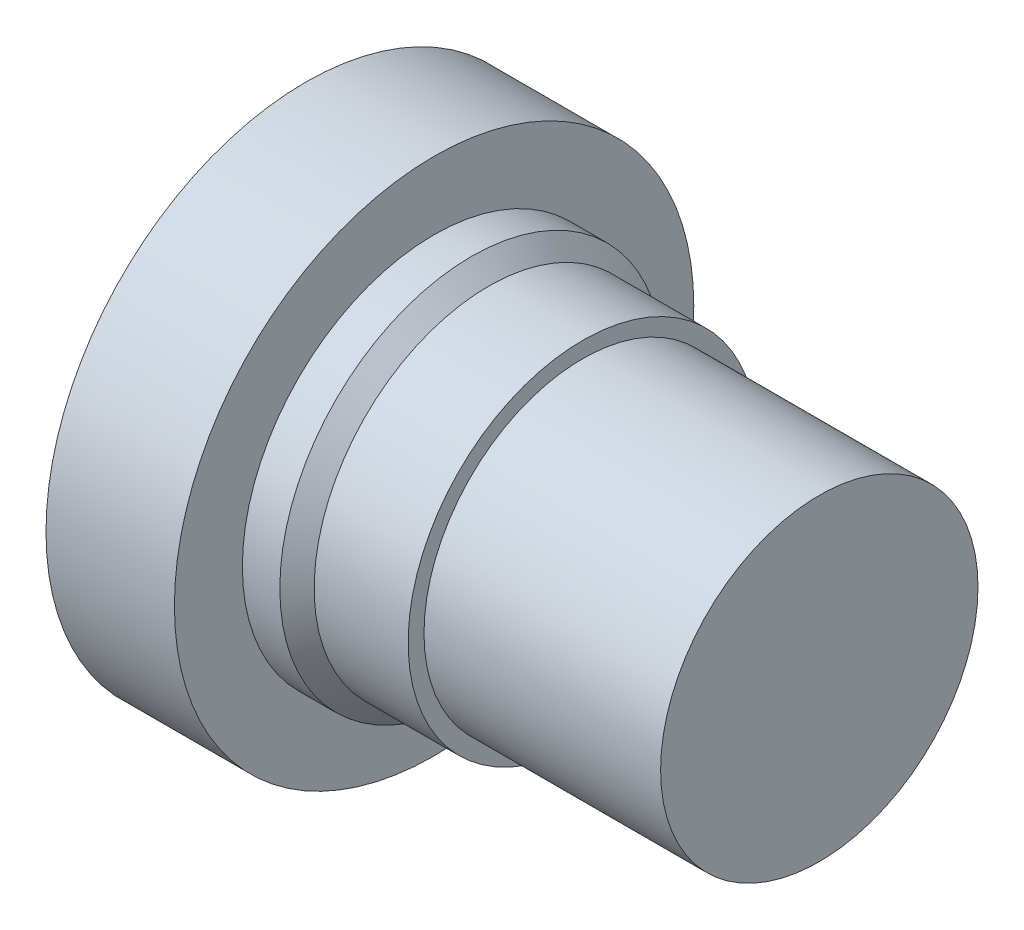
ISO-10303-21;
HEADER;
FILE_DESCRIPTION(('STEP AP214'),'2;1');
FILE_NAME('part.step','',(''),(''),'','','');
FILE_SCHEMA(('AUTOMOTIVE_DESIGN { 1 0 10303 214 1 1 1 1 }'));
ENDSEC;
DATA;
#1=APPLICATION_CONTEXT('core data for automotive mechanical design processes');
#2=APPLICATION_PROTOCOL_DEFINITION('international standard','automotive_design',2000,#1);
#3=PRODUCT_CONTEXT('',#1,'mechanical');
#4=PRODUCT('Part','Part','',(#3));
#5=PRODUCT_RELATED_PRODUCT_CATEGORY('part','',(#4));
#6=PRODUCT_DEFINITION_FORMATION('','',#4);
#7=PRODUCT_DEFINITION_CONTEXT('part definition',#1,'design');
#8=PRODUCT_DEFINITION('design','',#6,#7);
#9=PRODUCT_DEFINITION_SHAPE('','',#8);
#10=(LENGTH_UNIT() NAMED_UNIT(*) SI_UNIT(.MILLI.,.METRE.));
#11=(NAMED_UNIT(*) PLANE_ANGLE_UNIT() SI_UNIT($,.RADIAN.));
#12=(NAMED_UNIT(*) SI_UNIT($,.STERADIAN.) SOLID_ANGLE_UNIT());
#13=UNCERTAINTY_MEASURE_WITH_UNIT(LENGTH_MEASURE(1.E-05),#10,'distance_accuracy_value','');
#14=(GEOMETRIC_REPRESENTATION_CONTEXT(3) GLOBAL_UNCERTAINTY_ASSIGNED_CONTEXT((#13)) GLOBAL_UNIT_ASSIGNED_CONTEXT((#10,
#11,#12)) REPRESENTATION_CONTEXT('',''));
#15=CARTESIAN_POINT('',(0.,0.,0.));
#16=DIRECTION('',(0.,0.,1.));
#17=DIRECTION('',(1.,0.,0.));
#18=AXIS2_PLACEMENT_3D('',#15,#16,#17);
#19=CARTESIAN_POINT('',(0.,0.,0.));
#20=DIRECTION('',(-1.,0.,0.));
#21=DIRECTION('',(0.,0.,1.));
#22=AXIS2_PLACEMENT_3D('',#19,#20,#21);
#23=PLANE('',#22);
#24=CARTESIAN_POINT('',(0.,0.,0.));
#25=DIRECTION('',(-1.,0.,0.));
#26=DIRECTION('',(0.,0.,1.));
#27=AXIS2_PLACEMENT_3D('',#24,#25,#26);
#28=CIRCLE('',#27,7.);
#29=CARTESIAN_POINT('',(0.,0.,7.));
#30=VERTEX_POINT('',#29);
#31=EDGE_CURVE('E52',#30,#30,#28,.T.);
#32=ORIENTED_EDGE('',*,*,#31,.F.);
#33=EDGE_LOOP('',(#32));
#34=FACE_BOUND('',#33,.T.);
#35=CARTESIAN_POINT('',(0.,0.,0.));
#36=DIRECTION('',(1.,0.,0.));
#37=DIRECTION('',(0.,0.,-1.));
#38=AXIS2_PLACEMENT_3D('',#35,#36,#37);
#39=CIRCLE('',#38,9.);
#40=CARTESIAN_POINT('',(0.,0.,-9.));
#41=VERTEX_POINT('',#40);
#42=EDGE_CURVE('E11',#41,#41,#39,.T.);
#43=ORIENTED_EDGE('',*,*,#42,.F.);
#44=EDGE_LOOP('',(#43));
#45=FACE_BOUND('',#44,.T.);
#46=ADVANCED_FACE('F32',(#34,#45),#23,.T.);
#47=CARTESIAN_POINT('',(17.8,0.,0.));
#48=DIRECTION('',(1.,0.,0.));
#49=DIRECTION('',(0.,0.,-1.));
#50=AXIS2_PLACEMENT_3D('',#47,#48,#49);
#51=CYLINDRICAL_SURFACE('',#50,9.);
#52=ORIENTED_EDGE('',*,*,#42,.T.);
#53=EDGE_LOOP('',(#52));
#54=FACE_BOUND('',#53,.T.);
#55=CARTESIAN_POINT('',(4.45,0.,0.));
#56=DIRECTION('',(1.,0.,0.));
#57=DIRECTION('',(0.,0.,-1.));
#58=AXIS2_PLACEMENT_3D('',#55,#56,#57);
#59=CIRCLE('',#58,9.);
#60=CARTESIAN_POINT('',(4.45,0.,-9.));
#61=VERTEX_POINT('',#60);
#62=EDGE_CURVE('E40',#61,#61,#59,.T.);
#63=ORIENTED_EDGE('',*,*,#62,.F.);
#64=EDGE_LOOP('',(#63));
#65=FACE_BOUND('',#64,.T.);
#66=ADVANCED_FACE('F94',(#54,#65),#51,.T.);
#67=CARTESIAN_POINT('',(4.45,9.,0.));
#68=DIRECTION('',(1.,0.,0.));
#69=DIRECTION('',(0.,0.,-1.));
#70=AXIS2_PLACEMENT_3D('',#67,#68,#69);
#71=PLANE('',#70);
#72=ORIENTED_EDGE('',*,*,#62,.T.);
#73=EDGE_LOOP('',(#72));
#74=FACE_BOUND('',#73,.T.);
#75=CARTESIAN_POINT('',(4.45,0.,0.));
#76=DIRECTION('',(1.,0.,0.));
#77=DIRECTION('',(0.,0.,-1.));
#78=AXIS2_PLACEMENT_3D('',#75,#76,#77);
#79=CIRCLE('',#78,6.64519038076152);
#80=CARTESIAN_POINT('',(4.45,0.,-6.64519038076152));
#81=VERTEX_POINT('',#80);
#82=EDGE_CURVE('E61',#81,#81,#79,.T.);
#83=ORIENTED_EDGE('',*,*,#82,.F.);
#84=EDGE_LOOP('',(#83));
#85=FACE_BOUND('',#84,.T.);
#86=ADVANCED_FACE('F99',(#74,#85),#71,.T.);
#87=CARTESIAN_POINT('',(17.8,0.,0.));
#88=DIRECTION('',(1.,0.,0.));
#89=DIRECTION('',(0.,0.,-1.));
#90=AXIS2_PLACEMENT_3D('',#87,#88,#89);
#91=CYLINDRICAL_SURFACE('',#90,6.64519038076152);
#92=ORIENTED_EDGE('',*,*,#82,.T.);
#93=EDGE_LOOP('',(#92));
#94=FACE_BOUND('',#93,.T.);
#95=CARTESIAN_POINT('',(5.74859719438878,0.,0.));
#96=DIRECTION('',(1.,0.,0.));
#97=DIRECTION('',(0.,0.,-1.));
#98=AXIS2_PLACEMENT_3D('',#95,#96,#97);
#99=CIRCLE('',#98,6.64519038076152);
#100=CARTESIAN_POINT('',(5.74859719438878,0.,-6.64519038076152));
#101=VERTEX_POINT('',#100);
#102=EDGE_CURVE('E64',#101,#101,#99,.T.);
#103=ORIENTED_EDGE('',*,*,#102,.F.);
#104=EDGE_LOOP('',(#103));
#105=FACE_BOUND('',#104,.T.);
#106=ADVANCED_FACE('F107',(#94,#105),#91,.T.);
#107=CARTESIAN_POINT('',(6.34378757515031,0.,0.));
#108=DIRECTION('',(-1.,0.,0.));
#109=DIRECTION('',(0.,0.,1.));
#110=AXIS2_PLACEMENT_3D('',#107,#108,#109);
#111=CONICAL_SURFACE('',#110,6.05,0.785398163397447);
#112=ORIENTED_EDGE('',*,*,#102,.T.);
#113=EDGE_LOOP('',(#112));
#114=FACE_BOUND('',#113,.T.);
#115=CARTESIAN_POINT('',(6.34378757515031,0.,0.));
#116=DIRECTION('',(1.,0.,0.));
#117=DIRECTION('',(0.,0.,-1.));
#118=AXIS2_PLACEMENT_3D('',#115,#116,#117);
#119=CIRCLE('',#118,6.05);
#120=CARTESIAN_POINT('',(6.34378757515031,0.,-6.05));
#121=VERTEX_POINT('',#120);
#122=EDGE_CURVE('E67',#121,#121,#119,.T.);
#123=ORIENTED_EDGE('',*,*,#122,.F.);
#124=EDGE_LOOP('',(#123));
#125=FACE_BOUND('',#124,.T.);
#126=ADVANCED_FACE('F90',(#114,#125),#111,.T.);
#127=CARTESIAN_POINT('',(17.8,0.,0.));
#128=DIRECTION('',(1.,0.,0.));
#129=DIRECTION('',(0.,0.,-1.));
#130=AXIS2_PLACEMENT_3D('',#127,#128,#129);
#131=CYLINDRICAL_SURFACE('',#130,6.05);
#132=ORIENTED_EDGE('',*,*,#122,.T.);
#133=EDGE_LOOP('',(#132));
#134=FACE_BOUND('',#133,.T.);
#135=CARTESIAN_POINT('',(9.6,0.,0.));
#136=DIRECTION('',(1.,0.,0.));
#137=DIRECTION('',(0.,0.,-1.));
#138=AXIS2_PLACEMENT_3D('',#135,#136,#137);
#139=CIRCLE('',#138,6.05);
#140=CARTESIAN_POINT('',(9.6,0.,-6.05));
#141=VERTEX_POINT('',#140);
#142=EDGE_CURVE('E70',#141,#141,#139,.T.);
#143=ORIENTED_EDGE('',*,*,#142,.F.);
#144=EDGE_LOOP('',(#143));
#145=FACE_BOUND('',#144,.T.);
#146=ADVANCED_FACE('F81',(#134,#145),#131,.T.);
#147=CARTESIAN_POINT('',(9.6,6.05,0.));
#148=DIRECTION('',(1.,0.,0.));
#149=DIRECTION('',(0.,0.,-1.));
#150=AXIS2_PLACEMENT_3D('',#147,#148,#149);
#151=PLANE('',#150);
#152=ORIENTED_EDGE('',*,*,#142,.T.);
#153=EDGE_LOOP('',(#152));
#154=FACE_BOUND('',#153,.T.);
#155=CARTESIAN_POINT('',(9.6,0.,0.));
#156=DIRECTION('',(1.,0.,0.));
#157=DIRECTION('',(0.,0.,-1.));
#158=AXIS2_PLACEMENT_3D('',#155,#156,#157);
#159=CIRCLE('',#158,5.5);
#160=CARTESIAN_POINT('',(9.6,0.,-5.5));
#161=VERTEX_POINT('',#160);
#162=EDGE_CURVE('E54',#161,#161,#159,.T.);
#163=ORIENTED_EDGE('',*,*,#162,.F.);
#164=EDGE_LOOP('',(#163));
#165=FACE_BOUND('',#164,.T.);
#166=ADVANCED_FACE('F79',(#154,#165),#151,.T.);
#167=CARTESIAN_POINT('',(17.8,0.,0.));
#168=DIRECTION('',(1.,0.,0.));
#169=DIRECTION('',(0.,0.,-1.));
#170=AXIS2_PLACEMENT_3D('',#167,#168,#169);
#171=CYLINDRICAL_SURFACE('',#170,5.5);
#172=ORIENTED_EDGE('',*,*,#162,.T.);
#173=EDGE_LOOP('',(#172));
#174=FACE_BOUND('',#173,.T.);
#175=CARTESIAN_POINT('',(17.8,0.,0.));
#176=DIRECTION('',(1.,0.,0.));
#177=DIRECTION('',(0.,0.,-1.));
#178=AXIS2_PLACEMENT_3D('',#175,#176,#177);
#179=CIRCLE('',#178,5.5);
#180=CARTESIAN_POINT('',(17.8,0.,-5.5));
#181=VERTEX_POINT('',#180);
#182=EDGE_CURVE('E51',#181,#181,#179,.T.);
#183=ORIENTED_EDGE('',*,*,#182,.F.);
#184=EDGE_LOOP('',(#183));
#185=FACE_BOUND('',#184,.T.);
#186=ADVANCED_FACE('F76',(#174,#185),#171,.T.);
#187=CARTESIAN_POINT('',(17.8,5.5,0.));
#188=DIRECTION('',(1.,0.,0.));
#189=DIRECTION('',(0.,0.,-1.));
#190=AXIS2_PLACEMENT_3D('',#187,#188,#189);
#191=PLANE('',#190);
#192=ORIENTED_EDGE('',*,*,#182,.T.);
#193=EDGE_LOOP('',(#192));
#194=FACE_BOUND('',#193,.T.);
#195=ADVANCED_FACE('F88',(#194),#191,.T.);
#196=CARTESIAN_POINT('',(0.0001,0.,0.));
#197=DIRECTION('',(-1.,0.,0.));
#198=DIRECTION('',(0.,0.,1.));
#199=AXIS2_PLACEMENT_3D('',#196,#197,#198);
#200=CYLINDRICAL_SURFACE('',#199,7.);
#201=CARTESIAN_POINT('',(0.0001,0.,0.));
#202=DIRECTION('',(-1.,0.,0.));
#203=DIRECTION('',(0.,0.,1.));
#204=AXIS2_PLACEMENT_3D('',#201,#202,#203);
#205=CIRCLE('',#204,7.);
#206=CARTESIAN_POINT('',(0.0001,0.,7.));
#207=VERTEX_POINT('',#206);
#208=EDGE_CURVE('E49',#207,#207,#205,.T.);
#209=ORIENTED_EDGE('',*,*,#208,.F.);
#210=EDGE_LOOP('',(#209));
#211=FACE_BOUND('',#210,.T.);
#212=ORIENTED_EDGE('',*,*,#31,.T.);
#213=EDGE_LOOP('',(#212));
#214=FACE_BOUND('',#213,.T.);
#215=ADVANCED_FACE('F46',(#211,#214),#200,.F.);
#216=CARTESIAN_POINT('',(0.0001,0.,0.));
#217=DIRECTION('',(0.,1.,0.));
#218=DIRECTION('',(0.,0.,1.));
#219=AXIS2_PLACEMENT_3D('',#216,#217,#218);
#220=ELLIPSE('',#219,7.,1.4);
#221=TRIMMED_CURVE('',#220,(PARAMETER_VALUE(4.71238898038469)),
(PARAMETER_VALUE(7.85398163397448)),.T.,.PARAMETER.);
#222=CARTESIAN_POINT('',(1.4001,0.,0.));
#223=DIRECTION('',(-1.,0.,0.));
#224=AXIS1_PLACEMENT('',#222,#223);
#225=SURFACE_OF_REVOLUTION('',#221,#224);
#226=CARTESIAN_POINT('',(-1.3999,0.,0.));
#227=VERTEX_POINT('',#226);
#228=VERTEX_LOOP('',#227);
#229=FACE_BOUND('',#228,.T.);
#230=ORIENTED_EDGE('',*,*,#208,.T.);
#231=EDGE_LOOP('',(#230));
#232=FACE_BOUND('',#231,.T.);
#233=ADVANCED_FACE('F34',(#229,#232),#225,.F.);
#234=CLOSED_SHELL('',(#46,#66,#86,#106,#126,#146,#166,#186,#195,#215,#233));
#235=MANIFOLD_SOLID_BREP('B2',#234);
#236=ADVANCED_BREP_SHAPE_REPRESENTATION('',(#18,#235),#14);
#237=SHAPE_DEFINITION_REPRESENTATION(#9,#236);
ENDSEC;
END-ISO-10303-21;
